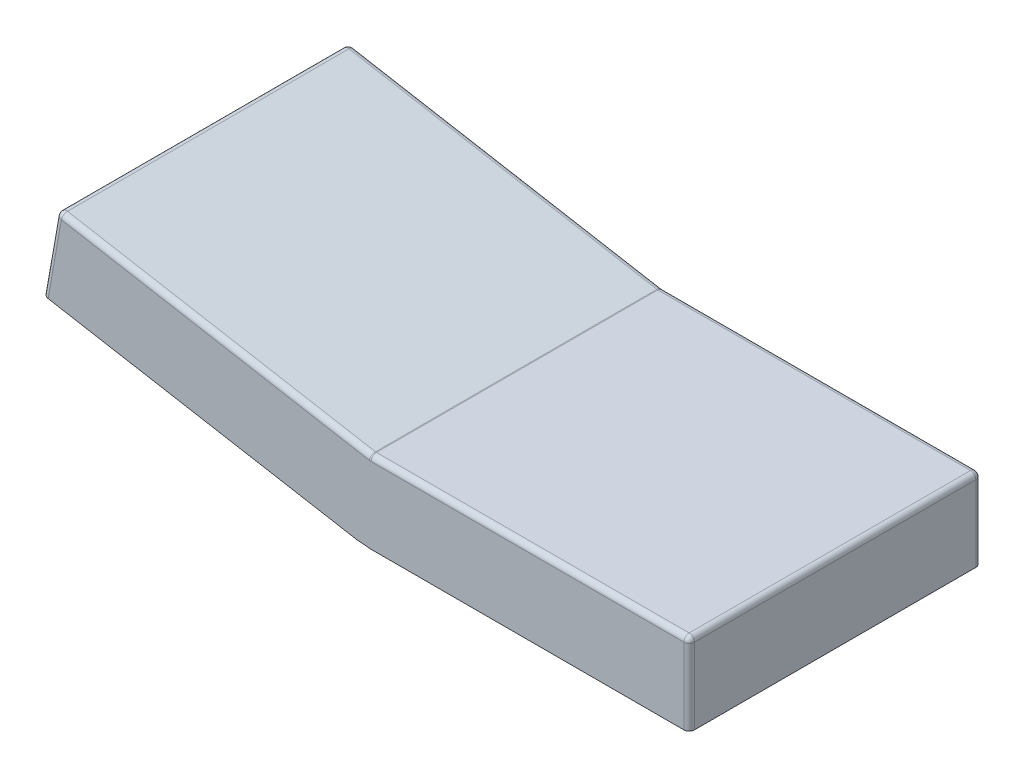
ISO-10303-21;
HEADER;
FILE_DESCRIPTION(('STEP AP214'),'2;1');
FILE_NAME('part.step','',(''),(''),'','','');
FILE_SCHEMA(('AUTOMOTIVE_DESIGN { 1 0 10303 214 1 1 1 1 }'));
ENDSEC;
DATA;
#1=APPLICATION_CONTEXT('core data for automotive mechanical design processes');
#2=APPLICATION_PROTOCOL_DEFINITION('international standard','automotive_design',2000,#1);
#3=PRODUCT_CONTEXT('',#1,'mechanical');
#4=PRODUCT('Part','Part','',(#3));
#5=PRODUCT_RELATED_PRODUCT_CATEGORY('part','',(#4));
#6=PRODUCT_DEFINITION_FORMATION('','',#4);
#7=PRODUCT_DEFINITION_CONTEXT('part definition',#1,'design');
#8=PRODUCT_DEFINITION('design','',#6,#7);
#9=PRODUCT_DEFINITION_SHAPE('','',#8);
#10=(LENGTH_UNIT() NAMED_UNIT(*) SI_UNIT(.MILLI.,.METRE.));
#11=(NAMED_UNIT(*) PLANE_ANGLE_UNIT() SI_UNIT($,.RADIAN.));
#12=(NAMED_UNIT(*) SI_UNIT($,.STERADIAN.) SOLID_ANGLE_UNIT());
#13=UNCERTAINTY_MEASURE_WITH_UNIT(LENGTH_MEASURE(1.E-05),#10,'distance_accuracy_value','');
#14=(GEOMETRIC_REPRESENTATION_CONTEXT(3) GLOBAL_UNCERTAINTY_ASSIGNED_CONTEXT((#13)) GLOBAL_UNIT_ASSIGNED_CONTEXT((#10,
#11,#12)) REPRESENTATION_CONTEXT('',''));
#15=CARTESIAN_POINT('',(0.,0.,0.));
#16=DIRECTION('',(0.,0.,1.));
#17=DIRECTION('',(1.,0.,0.));
#18=AXIS2_PLACEMENT_3D('',#15,#16,#17);
#19=CARTESIAN_POINT('',(-58.6396219021549,10.3397474798928,27.5));
#20=DIRECTION('',(0.984807753012209,-0.173648177666928,0.));
#21=DIRECTION('',(0.173648177666928,0.984807753012209,0.));
#22=AXIS2_PLACEMENT_3D('',#19,#20,#21);
#23=PLANE('',#22);
#24=DIRECTION('',(0.,0.,-1.));
#25=VECTOR('',#24,1.);
#26=CARTESIAN_POINT('',(-59.6310566791997,4.71704145350175,27.5));
#27=LINE('',#26,#25);
#28=CARTESIAN_POINT('',(-59.6310566791997,4.71704145350175,27.));
#29=VERTEX_POINT('',#28);
#30=CARTESIAN_POINT('',(-59.6310566791997,4.71704145350175,0.5));
#31=VERTEX_POINT('',#30);
#32=EDGE_CURVE('E53',#29,#31,#27,.T.);
#33=ORIENTED_EDGE('',*,*,#32,.T.);
#34=DIRECTION('',(-0.173648177666928,-0.984807753012209,0.));
#35=VECTOR('',#34,1.);
#36=CARTESIAN_POINT('',(-58.6396219021549,10.3397474798928,0.5));
#37=LINE('',#36,#35);
#38=CARTESIAN_POINT('',(-60.8739460215798,-2.33173427773504,0.5));
#39=VERTEX_POINT('',#38);
#40=EDGE_CURVE('E241',#31,#39,#37,.T.);
#41=ORIENTED_EDGE('',*,*,#40,.T.);
#42=DIRECTION('',(0.,0.,-1.));
#43=VECTOR('',#42,1.);
#44=CARTESIAN_POINT('',(-60.8739460215798,-2.33173427773504,27.5));
#45=LINE('',#44,#43);
#46=CARTESIAN_POINT('',(-60.8739460215798,-2.33173427773504,27.));
#47=VERTEX_POINT('',#46);
#48=EDGE_CURVE('E170',#47,#39,#45,.T.);
#49=ORIENTED_EDGE('',*,*,#48,.F.);
#50=DIRECTION('',(-0.173648177666928,-0.984807753012209,0.));
#51=VECTOR('',#50,1.);
#52=CARTESIAN_POINT('',(-59.5442325903662,5.20944533000785,27.));
#53=LINE('',#52,#51);
#54=EDGE_CURVE('E58',#47,#29,#53,.F.);
#55=ORIENTED_EDGE('',*,*,#54,.T.);
#56=EDGE_LOOP('',(#33,#41,#49,#55));
#57=FACE_BOUND('',#56,.T.);
#58=ADVANCED_FACE('F36',(#57),#23,.F.);
#59=CARTESIAN_POINT('',(-2.23432411942496,-12.671481757628,27.5));
#60=DIRECTION('',(0.173648177666931,0.984807753012208,0.));
#61=DIRECTION('',(-0.984807753012208,0.173648177666931,0.));
#62=AXIS2_PLACEMENT_3D('',#59,#60,#61);
#63=PLANE('',#62);
#64=ORIENTED_EDGE('',*,*,#48,.T.);
#65=CARTESIAN_POINT('',(-60.3815421450737,-2.41855836656851,0.5));
#66=DIRECTION('',(0.173648177666931,0.984807753012208,0.));
#67=DIRECTION('',(-0.984807753012208,0.173648177666931,0.));
#68=AXIS2_PLACEMENT_3D('',#65,#66,#67);
#69=CIRCLE('',#68,0.5);
#70=CARTESIAN_POINT('',(-60.3815421450737,-2.41855836656851,0.));
#71=VERTEX_POINT('',#70);
#72=EDGE_CURVE('E11',#39,#71,#69,.F.);
#73=ORIENTED_EDGE('',*,*,#72,.T.);
#74=DIRECTION('',(0.984807753012208,-0.173648177666931,0.));
#75=VECTOR('',#74,1.);
#76=CARTESIAN_POINT('',(-2.23432411942496,-12.671481757628,0.));
#77=LINE('',#76,#75);
#78=CARTESIAN_POINT('',(-31.3297134312136,-7.54117960774298,0.));
#79=VERTEX_POINT('',#78);
#80=EDGE_CURVE('E166',#71,#79,#77,.T.);
#81=ORIENTED_EDGE('',*,*,#80,.T.);
#82=DIRECTION('',(0.,0.,-1.));
#83=VECTOR('',#82,1.);
#84=CARTESIAN_POINT('',(-31.3297134312136,-7.54117960774298,27.5));
#85=LINE('',#84,#83);
#86=CARTESIAN_POINT('',(-31.3297134312136,-7.54117960774298,27.5));
#87=VERTEX_POINT('',#86);
#88=EDGE_CURVE('E162',#87,#79,#85,.T.);
#89=ORIENTED_EDGE('',*,*,#88,.F.);
#90=DIRECTION('',(0.984807753012208,-0.173648177666931,0.));
#91=VECTOR('',#90,1.);
#92=CARTESIAN_POINT('',(-2.23432411942496,-12.671481757628,27.5));
#93=LINE('',#92,#91);
#94=CARTESIAN_POINT('',(-60.3815421450737,-2.41855836656851,27.5));
#95=VERTEX_POINT('',#94);
#96=EDGE_CURVE('E149',#95,#87,#93,.T.);
#97=ORIENTED_EDGE('',*,*,#96,.F.);
#98=CARTESIAN_POINT('',(-60.3815421450737,-2.41855836656851,27.));
#99=DIRECTION('',(0.173648177666931,0.984807753012208,0.));
#100=DIRECTION('',(-0.984807753012208,0.173648177666931,0.));
#101=AXIS2_PLACEMENT_3D('',#98,#99,#100);
#102=CIRCLE('',#101,0.5);
#103=EDGE_CURVE('E45',#95,#47,#102,.F.);
#104=ORIENTED_EDGE('',*,*,#103,.T.);
#105=EDGE_LOOP('',(#64,#73,#81,#89,#97,#104));
#106=FACE_BOUND('',#105,.T.);
#107=ADVANCED_FACE('F164',(#106),#63,.F.);
#108=CARTESIAN_POINT('',(-0.892740420423577,-10.2040696982314,27.5));
#109=DIRECTION('',(-0.0871557427476516,-0.996194698091746,0.));
#110=DIRECTION('',(0.996194698091746,-0.0871557427476516,0.));
#111=AXIS2_PLACEMENT_3D('',#108,#109,#110);
#112=PLANE('',#111);
#113=DIRECTION('',(-0.996194698091746,0.0871557427476516,0.));
#114=VECTOR('',#113,1.);
#115=CARTESIAN_POINT('',(-0.892740420423577,-10.2040696982314,0.));
#116=LINE('',#115,#114);
#117=CARTESIAN_POINT('',(-30.,-7.65751445871232,0.));
#118=VERTEX_POINT('',#117);
#119=EDGE_CURVE('E182',#118,#79,#116,.T.);
#120=ORIENTED_EDGE('',*,*,#119,.F.);
#121=DIRECTION('',(0.,0.,-1.));
#122=VECTOR('',#121,1.);
#123=CARTESIAN_POINT('',(-30.,-7.65751445871232,27.5));
#124=LINE('',#123,#122);
#125=CARTESIAN_POINT('',(-30.,-7.65751445871232,27.5));
#126=VERTEX_POINT('',#125);
#127=EDGE_CURVE('E171',#126,#118,#124,.T.);
#128=ORIENTED_EDGE('',*,*,#127,.F.);
#129=DIRECTION('',(-0.996194698091746,0.0871557427476516,0.));
#130=VECTOR('',#129,1.);
#131=CARTESIAN_POINT('',(-0.892740420423577,-10.2040696982314,27.5));
#132=LINE('',#131,#130);
#133=EDGE_CURVE('E154',#126,#87,#132,.T.);
#134=ORIENTED_EDGE('',*,*,#133,.T.);
#135=ORIENTED_EDGE('',*,*,#88,.T.);
#136=EDGE_LOOP('',(#120,#128,#134,#135));
#137=FACE_BOUND('',#136,.T.);
#138=ADVANCED_FACE('F174',(#137),#112,.T.);
#139=CARTESIAN_POINT('',(0.,-7.65751445871231,27.5));
#140=DIRECTION('',(0.,-1.,0.));
#141=DIRECTION('',(1.,0.,0.));
#142=AXIS2_PLACEMENT_3D('',#139,#140,#141);
#143=PLANE('',#142);
#144=DIRECTION('',(0.,0.,-1.));
#145=VECTOR('',#144,1.);
#146=CARTESIAN_POINT('',(0.,-7.65751445871231,27.5));
#147=LINE('',#146,#145);
#148=CARTESIAN_POINT('',(0.,-7.65751445871231,27.));
#149=VERTEX_POINT('',#148);
#150=CARTESIAN_POINT('',(0.,-7.65751445871231,0.5));
#151=VERTEX_POINT('',#150);
#152=EDGE_CURVE('E178',#149,#151,#147,.T.);
#153=ORIENTED_EDGE('',*,*,#152,.F.);
#154=CARTESIAN_POINT('',(-0.499999999999999,-7.65751445871231,27.));
#155=DIRECTION('',(0.,-1.,0.));
#156=DIRECTION('',(1.,0.,0.));
#157=AXIS2_PLACEMENT_3D('',#154,#155,#156);
#158=CIRCLE('',#157,0.5);
#159=CARTESIAN_POINT('',(-0.499999999999999,-7.65751445871231,27.5));
#160=VERTEX_POINT('',#159);
#161=EDGE_CURVE('E216',#149,#160,#158,.T.);
#162=ORIENTED_EDGE('',*,*,#161,.T.);
#163=DIRECTION('',(-1.,0.,0.));
#164=VECTOR('',#163,1.);
#165=CARTESIAN_POINT('',(0.,-7.65751445871231,27.5));
#166=LINE('',#165,#164);
#167=EDGE_CURVE('E176',#160,#126,#166,.T.);
#168=ORIENTED_EDGE('',*,*,#167,.T.);
#169=ORIENTED_EDGE('',*,*,#127,.T.);
#170=DIRECTION('',(-1.,0.,0.));
#171=VECTOR('',#170,1.);
#172=CARTESIAN_POINT('',(0.,-7.65751445871231,0.));
#173=LINE('',#172,#171);
#174=CARTESIAN_POINT('',(-0.499999999999999,-7.65751445871231,0.));
#175=VERTEX_POINT('',#174);
#176=EDGE_CURVE('E159',#175,#118,#173,.T.);
#177=ORIENTED_EDGE('',*,*,#176,.F.);
#178=CARTESIAN_POINT('',(-0.499999999999999,-7.65751445871231,0.5));
#179=DIRECTION('',(0.,-1.,0.));
#180=DIRECTION('',(1.,0.,0.));
#181=AXIS2_PLACEMENT_3D('',#178,#179,#180);
#182=CIRCLE('',#181,0.5);
#183=EDGE_CURVE('E214',#175,#151,#182,.T.);
#184=ORIENTED_EDGE('',*,*,#183,.T.);
#185=EDGE_LOOP('',(#153,#162,#168,#169,#177,#184));
#186=FACE_BOUND('',#185,.T.);
#187=ADVANCED_FACE('F546',(#186),#143,.T.);
#188=CARTESIAN_POINT('',(0.,0.,27.5));
#189=DIRECTION('',(1.,0.,0.));
#190=DIRECTION('',(0.,1.,0.));
#191=AXIS2_PLACEMENT_3D('',#188,#189,#190);
#192=PLANE('',#191);
#193=DIRECTION('',(0.,0.,-1.));
#194=VECTOR('',#193,1.);
#195=CARTESIAN_POINT('',(0.,-0.5,27.5));
#196=LINE('',#195,#194);
#197=CARTESIAN_POINT('',(0.,-0.5,0.5));
#198=VERTEX_POINT('',#197);
#199=CARTESIAN_POINT('',(0.,-0.5,27.));
#200=VERTEX_POINT('',#199);
#201=EDGE_CURVE('E209',#198,#200,#196,.F.);
#202=ORIENTED_EDGE('',*,*,#201,.T.);
#203=DIRECTION('',(0.,-1.,0.));
#204=VECTOR('',#203,1.);
#205=CARTESIAN_POINT('',(0.,0.,27.));
#206=LINE('',#205,#204);
#207=EDGE_CURVE('E212',#200,#149,#206,.T.);
#208=ORIENTED_EDGE('',*,*,#207,.T.);
#209=ORIENTED_EDGE('',*,*,#152,.T.);
#210=DIRECTION('',(0.,-1.,0.));
#211=VECTOR('',#210,1.);
#212=CARTESIAN_POINT('',(0.,0.,0.5));
#213=LINE('',#212,#211);
#214=EDGE_CURVE('E207',#151,#198,#213,.F.);
#215=ORIENTED_EDGE('',*,*,#214,.T.);
#216=EDGE_LOOP('',(#202,#208,#209,#215));
#217=FACE_BOUND('',#216,.T.);
#218=ADVANCED_FACE('F311',(#217),#192,.T.);
#219=CARTESIAN_POINT('',(0.,0.,27.5));
#220=DIRECTION('',(0.,-1.,0.));
#221=DIRECTION('',(1.,0.,0.));
#222=AXIS2_PLACEMENT_3D('',#219,#220,#221);
#223=PLANE('',#222);
#224=DIRECTION('',(0.,0.,-1.));
#225=VECTOR('',#224,1.);
#226=CARTESIAN_POINT('',(-0.5,0.,0.));
#227=LINE('',#226,#225);
#228=CARTESIAN_POINT('',(-0.5,0.,27.));
#229=VERTEX_POINT('',#228);
#230=CARTESIAN_POINT('',(-0.5,0.,0.5));
#231=VERTEX_POINT('',#230);
#232=EDGE_CURVE('E200',#229,#231,#227,.T.);
#233=ORIENTED_EDGE('',*,*,#232,.T.);
#234=DIRECTION('',(-1.,0.,0.));
#235=VECTOR('',#234,1.);
#236=CARTESIAN_POINT('',(0.,0.,0.5));
#237=LINE('',#236,#235);
#238=CARTESIAN_POINT('',(-29.956255668237,0.,0.5));
#239=VERTEX_POINT('',#238);
#240=EDGE_CURVE('E205',#231,#239,#237,.T.);
#241=ORIENTED_EDGE('',*,*,#240,.T.);
#242=DIRECTION('',(0.,0.,-1.));
#243=VECTOR('',#242,1.);
#244=CARTESIAN_POINT('',(-29.956255668237,0.,27.5));
#245=LINE('',#244,#243);
#246=CARTESIAN_POINT('',(-29.956255668237,0.,27.));
#247=VERTEX_POINT('',#246);
#248=EDGE_CURVE('E202',#239,#247,#245,.F.);
#249=ORIENTED_EDGE('',*,*,#248,.T.);
#250=DIRECTION('',(-1.,0.,0.));
#251=VECTOR('',#250,1.);
#252=CARTESIAN_POINT('',(0.,0.,27.));
#253=LINE('',#252,#251);
#254=EDGE_CURVE('E198',#247,#229,#253,.F.);
#255=ORIENTED_EDGE('',*,*,#254,.T.);
#256=EDGE_LOOP('',(#233,#241,#249,#255));
#257=FACE_BOUND('',#256,.T.);
#258=ADVANCED_FACE('F330',(#257),#223,.F.);
#259=CARTESIAN_POINT('',(-0.904610688211361,-5.130302149885,27.5));
#260=DIRECTION('',(-0.173648177666929,-0.984807753012208,0.));
#261=DIRECTION('',(0.984807753012208,-0.173648177666929,0.));
#262=AXIS2_PLACEMENT_3D('',#259,#260,#261);
#263=PLANE('',#262);
#264=DIRECTION('',(-0.984807753012208,0.173648177666929,0.));
#265=VECTOR('',#264,1.);
#266=CARTESIAN_POINT('',(-30.,0.,27.));
#267=LINE('',#266,#265);
#268=CARTESIAN_POINT('',(-59.0518287138601,5.12262124117439,27.));
#269=VERTEX_POINT('',#268);
#270=CARTESIAN_POINT('',(-30.0430797570705,0.00759612349388308,27.));
#271=VERTEX_POINT('',#270);
#272=EDGE_CURVE('E191',#269,#271,#267,.F.);
#273=ORIENTED_EDGE('',*,*,#272,.T.);
#274=DIRECTION('',(0.,0.,-1.));
#275=VECTOR('',#274,1.);
#276=CARTESIAN_POINT('',(-30.0430797570705,0.00759612349388279,0.));
#277=LINE('',#276,#275);
#278=CARTESIAN_POINT('',(-30.0430797570705,0.00759612349388308,0.5));
#279=VERTEX_POINT('',#278);
#280=EDGE_CURVE('E195',#271,#279,#277,.T.);
#281=ORIENTED_EDGE('',*,*,#280,.T.);
#282=DIRECTION('',(-0.984807753012208,0.173648177666929,0.));
#283=VECTOR('',#282,1.);
#284=CARTESIAN_POINT('',(-0.904610688211361,-5.130302149885,0.5));
#285=LINE('',#284,#283);
#286=CARTESIAN_POINT('',(-59.0518287138601,5.12262124117439,0.5));
#287=VERTEX_POINT('',#286);
#288=EDGE_CURVE('E193',#279,#287,#285,.T.);
#289=ORIENTED_EDGE('',*,*,#288,.T.);
#290=DIRECTION('',(0.,0.,-1.));
#291=VECTOR('',#290,1.);
#292=CARTESIAN_POINT('',(-59.0518287138601,5.12262124117439,27.5));
#293=LINE('',#292,#291);
#294=EDGE_CURVE('E189',#287,#269,#293,.F.);
#295=ORIENTED_EDGE('',*,*,#294,.T.);
#296=EDGE_LOOP('',(#273,#281,#289,#295));
#297=FACE_BOUND('',#296,.T.);
#298=ADVANCED_FACE('F346',(#297),#263,.F.);
#299=CARTESIAN_POINT('',(0.,0.,27.5));
#300=DIRECTION('',(0.,0.,1.));
#301=DIRECTION('',(1.,0.,0.));
#302=AXIS2_PLACEMENT_3D('',#299,#300,#301);
#303=PLANE('',#302);
#304=ORIENTED_EDGE('',*,*,#167,.F.);
#305=DIRECTION('',(0.,-1.,0.));
#306=VECTOR('',#305,1.);
#307=CARTESIAN_POINT('',(-0.5,0.,27.5));
#308=LINE('',#307,#306);
#309=CARTESIAN_POINT('',(-0.5,-0.5,27.5));
#310=VERTEX_POINT('',#309);
#311=EDGE_CURVE('E226',#160,#310,#308,.F.);
#312=ORIENTED_EDGE('',*,*,#311,.T.);
#313=DIRECTION('',(-1.,0.,0.));
#314=VECTOR('',#313,1.);
#315=CARTESIAN_POINT('',(-30.,-0.500000000000012,27.5));
#316=LINE('',#315,#314);
#317=CARTESIAN_POINT('',(-29.956255668237,-0.500000000000012,27.5));
#318=VERTEX_POINT('',#317);
#319=EDGE_CURVE('E224',#310,#318,#316,.T.);
#320=ORIENTED_EDGE('',*,*,#319,.T.);
#321=CARTESIAN_POINT('',(-29.956255668237,0.499999999999988,27.5));
#322=DIRECTION('',(0.,0.,1.));
#323=DIRECTION('',(1.,0.,0.));
#324=AXIS2_PLACEMENT_3D('',#321,#322,#323);
#325=CIRCLE('',#324,1.);
#326=CARTESIAN_POINT('',(-30.129903845904,-0.484807753012221,27.5));
#327=VERTEX_POINT('',#326);
#328=EDGE_CURVE('E221',#327,#318,#325,.T.);
#329=ORIENTED_EDGE('',*,*,#328,.F.);
#330=DIRECTION('',(-0.984807753012208,0.173648177666929,0.));
#331=VECTOR('',#330,1.);
#332=CARTESIAN_POINT('',(-59.6310566791997,4.71704145350175,27.5));
#333=LINE('',#332,#331);
#334=CARTESIAN_POINT('',(-59.1386528026936,4.63021736466828,27.5));
#335=VERTEX_POINT('',#334);
#336=EDGE_CURVE('E218',#327,#335,#333,.T.);
#337=ORIENTED_EDGE('',*,*,#336,.T.);
#338=DIRECTION('',(-0.173648177666928,-0.984807753012209,0.));
#339=VECTOR('',#338,1.);
#340=CARTESIAN_POINT('',(-60.3815421450737,-2.41855836656851,27.5));
#341=LINE('',#340,#339);
#342=EDGE_CURVE('E156',#335,#95,#341,.T.);
#343=ORIENTED_EDGE('',*,*,#342,.T.);
#344=ORIENTED_EDGE('',*,*,#96,.T.);
#345=ORIENTED_EDGE('',*,*,#133,.F.);
#346=EDGE_LOOP('',(#304,#312,#320,#329,#337,#343,#344,#345));
#347=FACE_BOUND('',#346,.T.);
#348=ADVANCED_FACE('F152',(#347),#303,.T.);
#349=CARTESIAN_POINT('',(0.,0.,0.));
#350=DIRECTION('',(0.,0.,1.));
#351=DIRECTION('',(1.,0.,0.));
#352=AXIS2_PLACEMENT_3D('',#349,#350,#351);
#353=PLANE('',#352);
#354=DIRECTION('',(-1.,0.,0.));
#355=VECTOR('',#354,1.);
#356=CARTESIAN_POINT('',(0.,-0.5,0.));
#357=LINE('',#356,#355);
#358=CARTESIAN_POINT('',(-29.956255668237,-0.500000000000012,0.));
#359=VERTEX_POINT('',#358);
#360=CARTESIAN_POINT('',(-0.5,-0.5,0.));
#361=VERTEX_POINT('',#360);
#362=EDGE_CURVE('E235',#359,#361,#357,.F.);
#363=ORIENTED_EDGE('',*,*,#362,.T.);
#364=DIRECTION('',(0.,-1.,0.));
#365=VECTOR('',#364,1.);
#366=CARTESIAN_POINT('',(-0.499999999999999,-7.65751445871231,0.));
#367=LINE('',#366,#365);
#368=EDGE_CURVE('E237',#361,#175,#367,.T.);
#369=ORIENTED_EDGE('',*,*,#368,.T.);
#370=ORIENTED_EDGE('',*,*,#176,.T.);
#371=ORIENTED_EDGE('',*,*,#119,.T.);
#372=ORIENTED_EDGE('',*,*,#80,.F.);
#373=DIRECTION('',(-0.173648177666928,-0.984807753012209,0.));
#374=VECTOR('',#373,1.);
#375=CARTESIAN_POINT('',(-58.1472180256488,10.2529233910593,0.));
#376=LINE('',#375,#374);
#377=CARTESIAN_POINT('',(-59.1386528026936,4.63021736466828,0.));
#378=VERTEX_POINT('',#377);
#379=EDGE_CURVE('E233',#71,#378,#376,.F.);
#380=ORIENTED_EDGE('',*,*,#379,.T.);
#381=DIRECTION('',(-0.984807753012208,0.173648177666929,0.));
#382=VECTOR('',#381,1.);
#383=CARTESIAN_POINT('',(-0.991434777044826,-5.62270602639111,0.));
#384=LINE('',#383,#382);
#385=CARTESIAN_POINT('',(-30.129903845904,-0.484807753012221,0.));
#386=VERTEX_POINT('',#385);
#387=EDGE_CURVE('E231',#378,#386,#384,.F.);
#388=ORIENTED_EDGE('',*,*,#387,.T.);
#389=CARTESIAN_POINT('',(-29.956255668237,0.499999999999988,0.));
#390=DIRECTION('',(0.,0.,1.));
#391=DIRECTION('',(1.,0.,0.));
#392=AXIS2_PLACEMENT_3D('',#389,#390,#391);
#393=CIRCLE('',#392,1.);
#394=EDGE_CURVE('E228',#359,#386,#393,.F.);
#395=ORIENTED_EDGE('',*,*,#394,.F.);
#396=EDGE_LOOP('',(#363,#369,#370,#371,#372,#380,#388,#395));
#397=FACE_BOUND('',#396,.T.);
#398=ADVANCED_FACE('F501',(#397),#353,.F.);
#399=CARTESIAN_POINT('',(-0.5,0.,27.));
#400=DIRECTION('',(0.,-1.,0.));
#401=DIRECTION('',(1.,0.,0.));
#402=AXIS2_PLACEMENT_3D('',#399,#400,#401);
#403=CYLINDRICAL_SURFACE('',#402,0.5);
#404=ORIENTED_EDGE('',*,*,#161,.F.);
#405=ORIENTED_EDGE('',*,*,#207,.F.);
#406=CARTESIAN_POINT('',(-0.5,-0.5,27.));
#407=DIRECTION('',(0.,1.,0.));
#408=DIRECTION('',(-1.,0.,0.));
#409=AXIS2_PLACEMENT_3D('',#406,#407,#408);
#410=CIRCLE('',#409,0.5);
#411=EDGE_CURVE('E289',#310,#200,#410,.T.);
#412=ORIENTED_EDGE('',*,*,#411,.F.);
#413=ORIENTED_EDGE('',*,*,#311,.F.);
#414=EDGE_LOOP('',(#404,#405,#412,#413));
#415=FACE_BOUND('',#414,.T.);
#416=ADVANCED_FACE('F38',(#415),#403,.T.);
#417=CARTESIAN_POINT('',(-58.1472180256488,10.2529233910593,27.));
#418=DIRECTION('',(0.173648177666928,0.984807753012209,0.));
#419=DIRECTION('',(-0.984807753012209,0.173648177666928,0.));
#420=AXIS2_PLACEMENT_3D('',#417,#418,#419);
#421=CYLINDRICAL_SURFACE('',#420,0.5);
#422=ORIENTED_EDGE('',*,*,#103,.F.);
#423=ORIENTED_EDGE('',*,*,#342,.F.);
#424=CARTESIAN_POINT('',(-59.1386528026936,4.63021736466828,27.));
#425=DIRECTION('',(0.173648177666928,0.984807753012209,0.));
#426=DIRECTION('',(-0.984807753012209,0.173648177666928,0.));
#427=AXIS2_PLACEMENT_3D('',#424,#425,#426);
#428=CIRCLE('',#427,0.5);
#429=EDGE_CURVE('E287',#29,#335,#428,.T.);
#430=ORIENTED_EDGE('',*,*,#429,.F.);
#431=ORIENTED_EDGE('',*,*,#54,.F.);
#432=EDGE_LOOP('',(#422,#423,#430,#431));
#433=FACE_BOUND('',#432,.T.);
#434=ADVANCED_FACE('F483',(#433),#421,.T.);
#435=CARTESIAN_POINT('',(-59.1386528026936,4.63021736466828,27.5));
#436=DIRECTION('',(0.,0.,-1.));
#437=DIRECTION('',(-1.,0.,0.));
#438=AXIS2_PLACEMENT_3D('',#435,#436,#437);
#439=CYLINDRICAL_SURFACE('',#438,0.5);
#440=CARTESIAN_POINT('',(-59.1386528026936,4.63021736466828,0.5));
#441=DIRECTION('',(0.,0.,-1.));
#442=DIRECTION('',(-1.,0.,0.));
#443=AXIS2_PLACEMENT_3D('',#440,#441,#442);
#444=CIRCLE('',#443,0.5);
#445=EDGE_CURVE('E281',#31,#287,#444,.T.);
#446=ORIENTED_EDGE('',*,*,#445,.F.);
#447=ORIENTED_EDGE('',*,*,#32,.F.);
#448=CARTESIAN_POINT('',(-59.1386528026936,4.63021736466828,27.));
#449=DIRECTION('',(0.,0.,1.));
#450=DIRECTION('',(1.,0.,0.));
#451=AXIS2_PLACEMENT_3D('',#448,#449,#450);
#452=CIRCLE('',#451,0.5);
#453=EDGE_CURVE('E284',#269,#29,#452,.T.);
#454=ORIENTED_EDGE('',*,*,#453,.F.);
#455=ORIENTED_EDGE('',*,*,#294,.F.);
#456=EDGE_LOOP('',(#446,#447,#454,#455));
#457=FACE_BOUND('',#456,.T.);
#458=ADVANCED_FACE('F473',(#457),#439,.T.);
#459=CARTESIAN_POINT('',(-58.1472180256488,10.2529233910593,0.5));
#460=DIRECTION('',(-0.173648177666928,-0.984807753012209,0.));
#461=DIRECTION('',(0.984807753012209,-0.173648177666928,0.));
#462=AXIS2_PLACEMENT_3D('',#459,#460,#461);
#463=CYLINDRICAL_SURFACE('',#462,0.5);
#464=ORIENTED_EDGE('',*,*,#72,.F.);
#465=ORIENTED_EDGE('',*,*,#40,.F.);
#466=CARTESIAN_POINT('',(-59.1386528026936,4.63021736466829,0.5));
#467=DIRECTION('',(0.173648177666924,0.984807753012209,0.));
#468=DIRECTION('',(-0.984807753012209,0.173648177666924,0.));
#469=AXIS2_PLACEMENT_3D('',#466,#467,#468);
#470=CIRCLE('',#469,0.5);
#471=EDGE_CURVE('E278',#378,#31,#470,.T.);
#472=ORIENTED_EDGE('',*,*,#471,.F.);
#473=ORIENTED_EDGE('',*,*,#379,.F.);
#474=EDGE_LOOP('',(#464,#465,#472,#473));
#475=FACE_BOUND('',#474,.T.);
#476=ADVANCED_FACE('F464',(#475),#463,.T.);
#477=CARTESIAN_POINT('',(-0.5,0.,0.5));
#478=DIRECTION('',(0.,1.,0.));
#479=DIRECTION('',(-1.,0.,0.));
#480=AXIS2_PLACEMENT_3D('',#477,#478,#479);
#481=CYLINDRICAL_SURFACE('',#480,0.5);
#482=ORIENTED_EDGE('',*,*,#183,.F.);
#483=ORIENTED_EDGE('',*,*,#368,.F.);
#484=CARTESIAN_POINT('',(-0.5,-0.5,0.5));
#485=DIRECTION('',(0.,1.,0.));
#486=DIRECTION('',(-1.,0.,0.));
#487=AXIS2_PLACEMENT_3D('',#484,#485,#486);
#488=CIRCLE('',#487,0.5);
#489=EDGE_CURVE('E275',#198,#361,#488,.T.);
#490=ORIENTED_EDGE('',*,*,#489,.F.);
#491=ORIENTED_EDGE('',*,*,#214,.F.);
#492=EDGE_LOOP('',(#482,#483,#490,#491));
#493=FACE_BOUND('',#492,.T.);
#494=ADVANCED_FACE('F320',(#493),#481,.T.);
#495=CARTESIAN_POINT('',(-0.5,-0.5,27.5));
#496=DIRECTION('',(0.,0.,1.));
#497=DIRECTION('',(1.,0.,0.));
#498=AXIS2_PLACEMENT_3D('',#495,#496,#497);
#499=CYLINDRICAL_SURFACE('',#498,0.5);
#500=CARTESIAN_POINT('',(-0.5,-0.5,27.));
#501=DIRECTION('',(0.,0.,1.));
#502=DIRECTION('',(1.,0.,0.));
#503=AXIS2_PLACEMENT_3D('',#500,#501,#502);
#504=CIRCLE('',#503,0.5);
#505=EDGE_CURVE('E40',#200,#229,#504,.T.);
#506=ORIENTED_EDGE('',*,*,#505,.F.);
#507=ORIENTED_EDGE('',*,*,#201,.F.);
#508=CARTESIAN_POINT('',(-0.5,-0.5,0.5));
#509=DIRECTION('',(0.,0.,-1.));
#510=DIRECTION('',(-1.,0.,0.));
#511=AXIS2_PLACEMENT_3D('',#508,#509,#510);
#512=CIRCLE('',#511,0.5);
#513=EDGE_CURVE('E272',#231,#198,#512,.T.);
#514=ORIENTED_EDGE('',*,*,#513,.F.);
#515=ORIENTED_EDGE('',*,*,#232,.F.);
#516=EDGE_LOOP('',(#506,#507,#514,#515));
#517=FACE_BOUND('',#516,.T.);
#518=ADVANCED_FACE('F315',(#517),#499,.T.);
#519=CARTESIAN_POINT('',(-0.5,-0.5,27.));
#520=DIRECTION('',(0.,0.,1.));
#521=DIRECTION('',(1.,0.,0.));
#522=AXIS2_PLACEMENT_3D('',#519,#520,#521);
#523=SPHERICAL_SURFACE('',#522,0.5);
#524=ORIENTED_EDGE('',*,*,#411,.T.);
#525=ORIENTED_EDGE('',*,*,#505,.T.);
#526=CARTESIAN_POINT('',(-0.5,-0.5,27.));
#527=DIRECTION('',(1.,0.,0.));
#528=DIRECTION('',(0.,1.,0.));
#529=AXIS2_PLACEMENT_3D('',#526,#527,#528);
#530=CIRCLE('',#529,0.5);
#531=EDGE_CURVE('E269',#310,#229,#530,.F.);
#532=ORIENTED_EDGE('',*,*,#531,.F.);
#533=EDGE_LOOP('',(#524,#525,#532));
#534=FACE_BOUND('',#533,.T.);
#535=ADVANCED_FACE('F295',(#534),#523,.T.);
#536=CARTESIAN_POINT('',(-59.1386528026936,4.63021736466828,27.));
#537=DIRECTION('',(0.,0.,1.));
#538=DIRECTION('',(1.,0.,0.));
#539=AXIS2_PLACEMENT_3D('',#536,#537,#538);
#540=SPHERICAL_SURFACE('',#539,0.5);
#541=ORIENTED_EDGE('',*,*,#453,.T.);
#542=ORIENTED_EDGE('',*,*,#429,.T.);
#543=CARTESIAN_POINT('',(-59.1386528026936,4.63021736466828,27.));
#544=DIRECTION('',(-0.984807753012207,0.173648177666935,0.));
#545=DIRECTION('',(-0.173648177666935,-0.984807753012207,0.));
#546=AXIS2_PLACEMENT_3D('',#543,#544,#545);
#547=CIRCLE('',#546,0.5);
#548=EDGE_CURVE('E266',#269,#335,#547,.F.);
#549=ORIENTED_EDGE('',*,*,#548,.F.);
#550=EDGE_LOOP('',(#541,#542,#549));
#551=FACE_BOUND('',#550,.T.);
#552=ADVANCED_FACE('F429',(#551),#540,.T.);
#553=CARTESIAN_POINT('',(-59.1386528026936,4.63021736466828,0.5));
#554=DIRECTION('',(0.,0.,1.));
#555=DIRECTION('',(1.,0.,0.));
#556=AXIS2_PLACEMENT_3D('',#553,#554,#555);
#557=SPHERICAL_SURFACE('',#556,0.5);
#558=ORIENTED_EDGE('',*,*,#471,.T.);
#559=ORIENTED_EDGE('',*,*,#445,.T.);
#560=CARTESIAN_POINT('',(-59.1386528026936,4.63021736466828,0.5));
#561=DIRECTION('',(-0.984807753012207,0.173648177666935,0.));
#562=DIRECTION('',(-0.173648177666935,-0.984807753012207,0.));
#563=AXIS2_PLACEMENT_3D('',#560,#561,#562);
#564=CIRCLE('',#563,0.5);
#565=EDGE_CURVE('E263',#378,#287,#564,.F.);
#566=ORIENTED_EDGE('',*,*,#565,.F.);
#567=EDGE_LOOP('',(#558,#559,#566));
#568=FACE_BOUND('',#567,.T.);
#569=ADVANCED_FACE('F420',(#568),#557,.T.);
#570=CARTESIAN_POINT('',(-0.5,-0.5,0.5));
#571=DIRECTION('',(0.,0.,1.));
#572=DIRECTION('',(1.,0.,0.));
#573=AXIS2_PLACEMENT_3D('',#570,#571,#572);
#574=SPHERICAL_SURFACE('',#573,0.5);
#575=ORIENTED_EDGE('',*,*,#513,.T.);
#576=ORIENTED_EDGE('',*,*,#489,.T.);
#577=CARTESIAN_POINT('',(-0.5,-0.5,0.5));
#578=DIRECTION('',(1.,0.,0.));
#579=DIRECTION('',(0.,1.,0.));
#580=AXIS2_PLACEMENT_3D('',#577,#578,#579);
#581=CIRCLE('',#580,0.5);
#582=EDGE_CURVE('E260',#231,#361,#581,.F.);
#583=ORIENTED_EDGE('',*,*,#582,.F.);
#584=EDGE_LOOP('',(#575,#576,#583));
#585=FACE_BOUND('',#584,.T.);
#586=ADVANCED_FACE('F322',(#585),#574,.T.);
#587=CARTESIAN_POINT('',(0.,-0.5,27.));
#588=DIRECTION('',(1.,0.,0.));
#589=DIRECTION('',(0.,1.,0.));
#590=AXIS2_PLACEMENT_3D('',#587,#588,#589);
#591=CYLINDRICAL_SURFACE('',#590,0.5);
#592=ORIENTED_EDGE('',*,*,#531,.T.);
#593=ORIENTED_EDGE('',*,*,#254,.F.);
#594=CARTESIAN_POINT('',(-29.956255668237,-0.500000000000012,27.));
#595=DIRECTION('',(-1.,0.,0.));
#596=DIRECTION('',(0.,0.,1.));
#597=AXIS2_PLACEMENT_3D('',#594,#595,#596);
#598=CIRCLE('',#597,0.5);
#599=EDGE_CURVE('E257',#318,#247,#598,.T.);
#600=ORIENTED_EDGE('',*,*,#599,.F.);
#601=ORIENTED_EDGE('',*,*,#319,.F.);
#602=EDGE_LOOP('',(#592,#593,#600,#601));
#603=FACE_BOUND('',#602,.T.);
#604=ADVANCED_FACE('F303',(#603),#591,.T.);
#605=CARTESIAN_POINT('',(-0.991434777044826,-5.62270602639111,27.));
#606=DIRECTION('',(0.984807753012208,-0.173648177666929,0.));
#607=DIRECTION('',(0.173648177666929,0.984807753012208,0.));
#608=AXIS2_PLACEMENT_3D('',#605,#606,#607);
#609=CYLINDRICAL_SURFACE('',#608,0.5);
#610=ORIENTED_EDGE('',*,*,#548,.T.);
#611=ORIENTED_EDGE('',*,*,#336,.F.);
#612=CARTESIAN_POINT('',(-30.129903845904,-0.484807753012221,27.));
#613=DIRECTION('',(0.984807753012208,-0.173648177666928,0.));
#614=DIRECTION('',(0.173648177666928,0.984807753012208,0.));
#615=AXIS2_PLACEMENT_3D('',#612,#613,#614);
#616=CIRCLE('',#615,0.5);
#617=EDGE_CURVE('E254',#271,#327,#616,.T.);
#618=ORIENTED_EDGE('',*,*,#617,.F.);
#619=ORIENTED_EDGE('',*,*,#272,.F.);
#620=EDGE_LOOP('',(#610,#611,#618,#619));
#621=FACE_BOUND('',#620,.T.);
#622=ADVANCED_FACE('F351',(#621),#609,.T.);
#623=CARTESIAN_POINT('',(-0.991434777044826,-5.62270602639111,0.5));
#624=DIRECTION('',(-0.984807753012208,0.173648177666929,0.));
#625=DIRECTION('',(-0.173648177666929,-0.984807753012208,0.));
#626=AXIS2_PLACEMENT_3D('',#623,#624,#625);
#627=CYLINDRICAL_SURFACE('',#626,0.5);
#628=ORIENTED_EDGE('',*,*,#565,.T.);
#629=ORIENTED_EDGE('',*,*,#288,.F.);
#630=CARTESIAN_POINT('',(-30.129903845904,-0.484807753012221,0.5));
#631=DIRECTION('',(0.984807753012208,-0.173648177666928,0.));
#632=DIRECTION('',(0.173648177666928,0.984807753012208,0.));
#633=AXIS2_PLACEMENT_3D('',#630,#631,#632);
#634=CIRCLE('',#633,0.5);
#635=EDGE_CURVE('E251',#386,#279,#634,.T.);
#636=ORIENTED_EDGE('',*,*,#635,.F.);
#637=ORIENTED_EDGE('',*,*,#387,.F.);
#638=EDGE_LOOP('',(#628,#629,#636,#637));
#639=FACE_BOUND('',#638,.T.);
#640=ADVANCED_FACE('F342',(#639),#627,.T.);
#641=CARTESIAN_POINT('',(0.,-0.5,0.5));
#642=DIRECTION('',(-1.,0.,0.));
#643=DIRECTION('',(0.,-1.,0.));
#644=AXIS2_PLACEMENT_3D('',#641,#642,#643);
#645=CYLINDRICAL_SURFACE('',#644,0.5);
#646=ORIENTED_EDGE('',*,*,#582,.T.);
#647=ORIENTED_EDGE('',*,*,#362,.F.);
#648=CARTESIAN_POINT('',(-29.956255668237,-0.500000000000012,0.5));
#649=DIRECTION('',(-1.,0.,0.));
#650=DIRECTION('',(0.,0.,1.));
#651=AXIS2_PLACEMENT_3D('',#648,#649,#650);
#652=CIRCLE('',#651,0.5);
#653=EDGE_CURVE('E248',#239,#359,#652,.T.);
#654=ORIENTED_EDGE('',*,*,#653,.F.);
#655=ORIENTED_EDGE('',*,*,#240,.F.);
#656=EDGE_LOOP('',(#646,#647,#654,#655));
#657=FACE_BOUND('',#656,.T.);
#658=ADVANCED_FACE('F327',(#657),#645,.T.);
#659=CARTESIAN_POINT('',(-29.956255668237,0.499999999999988,27.));
#660=DIRECTION('',(0.,0.,1.));
#661=DIRECTION('',(1.,0.,0.));
#662=AXIS2_PLACEMENT_3D('',#659,#660,#661);
#663=TOROIDAL_SURFACE('',#662,1.,0.5);
#664=ORIENTED_EDGE('',*,*,#328,.T.);
#665=ORIENTED_EDGE('',*,*,#599,.T.);
#666=CARTESIAN_POINT('',(-29.956255668237,0.499999999999988,27.));
#667=DIRECTION('',(0.,0.,1.));
#668=DIRECTION('',(1.,0.,0.));
#669=AXIS2_PLACEMENT_3D('',#666,#667,#668);
#670=CIRCLE('',#669,0.5);
#671=EDGE_CURVE('E246',#271,#247,#670,.T.);
#672=ORIENTED_EDGE('',*,*,#671,.F.);
#673=ORIENTED_EDGE('',*,*,#617,.T.);
#674=EDGE_LOOP('',(#664,#665,#672,#673));
#675=FACE_BOUND('',#674,.T.);
#676=ADVANCED_FACE('F353',(#675),#663,.T.);
#677=CARTESIAN_POINT('',(-29.956255668237,0.499999999999988,0.5));
#678=DIRECTION('',(0.,0.,1.));
#679=DIRECTION('',(1.,0.,0.));
#680=AXIS2_PLACEMENT_3D('',#677,#678,#679);
#681=TOROIDAL_SURFACE('',#680,1.,0.5);
#682=ORIENTED_EDGE('',*,*,#394,.T.);
#683=ORIENTED_EDGE('',*,*,#635,.T.);
#684=CARTESIAN_POINT('',(-29.956255668237,0.499999999999988,0.5));
#685=DIRECTION('',(0.,0.,1.));
#686=DIRECTION('',(1.,0.,0.));
#687=AXIS2_PLACEMENT_3D('',#684,#685,#686);
#688=CIRCLE('',#687,0.5);
#689=EDGE_CURVE('E244',#239,#279,#688,.F.);
#690=ORIENTED_EDGE('',*,*,#689,.F.);
#691=ORIENTED_EDGE('',*,*,#653,.T.);
#692=EDGE_LOOP('',(#682,#683,#690,#691));
#693=FACE_BOUND('',#692,.T.);
#694=ADVANCED_FACE('F337',(#693),#681,.T.);
#695=CARTESIAN_POINT('',(-29.956255668237,0.499999999999988,27.5));
#696=DIRECTION('',(0.,0.,1.));
#697=DIRECTION('',(1.,0.,0.));
#698=AXIS2_PLACEMENT_3D('',#695,#696,#697);
#699=CYLINDRICAL_SURFACE('',#698,0.5);
#700=ORIENTED_EDGE('',*,*,#671,.T.);
#701=ORIENTED_EDGE('',*,*,#248,.F.);
#702=ORIENTED_EDGE('',*,*,#689,.T.);
#703=ORIENTED_EDGE('',*,*,#280,.F.);
#704=EDGE_LOOP('',(#700,#701,#702,#703));
#705=FACE_BOUND('',#704,.T.);
#706=ADVANCED_FACE('F333',(#705),#699,.F.);
#707=CLOSED_SHELL('',(#58,#107,#138,#187,#218,#258,#298,#348,#398,#416,#434,#458,#476,#494,#518,
#535,#552,#569,#586,#604,#622,#640,#658,#676,#694,#706));
#708=MANIFOLD_SOLID_BREP('B2',#707);
#709=ADVANCED_BREP_SHAPE_REPRESENTATION('',(#18,#708),#14);
#710=SHAPE_DEFINITION_REPRESENTATION(#9,#709);
ENDSEC;
END-ISO-10303-21;
